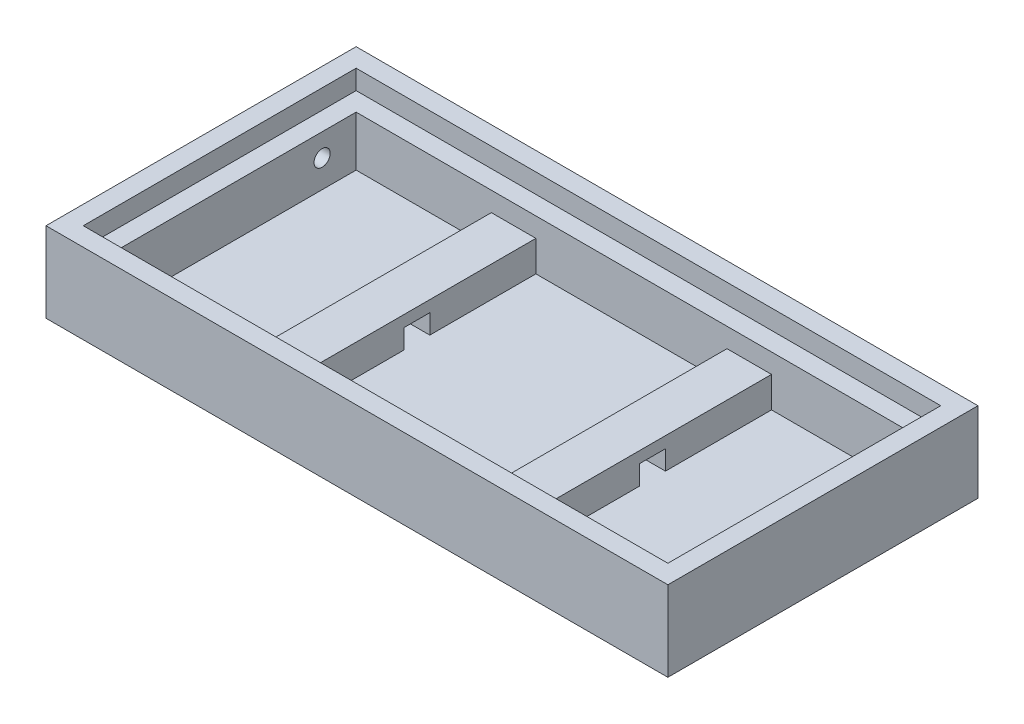
ISO-10303-21;
HEADER;
FILE_DESCRIPTION(('STEP AP214'),'2;1');
FILE_NAME('part.step','',(''),(''),'','','');
FILE_SCHEMA(('AUTOMOTIVE_DESIGN { 1 0 10303 214 1 1 1 1 }'));
ENDSEC;
DATA;
#1=APPLICATION_CONTEXT('core data for automotive mechanical design processes');
#2=APPLICATION_PROTOCOL_DEFINITION('international standard','automotive_design',2000,#1);
#3=PRODUCT_CONTEXT('',#1,'mechanical');
#4=PRODUCT('Part','Part','',(#3));
#5=PRODUCT_RELATED_PRODUCT_CATEGORY('part','',(#4));
#6=PRODUCT_DEFINITION_FORMATION('','',#4);
#7=PRODUCT_DEFINITION_CONTEXT('part definition',#1,'design');
#8=PRODUCT_DEFINITION('design','',#6,#7);
#9=PRODUCT_DEFINITION_SHAPE('','',#8);
#10=(LENGTH_UNIT() NAMED_UNIT(*) SI_UNIT(.MILLI.,.METRE.));
#11=(NAMED_UNIT(*) PLANE_ANGLE_UNIT() SI_UNIT($,.RADIAN.));
#12=(NAMED_UNIT(*) SI_UNIT($,.STERADIAN.) SOLID_ANGLE_UNIT());
#13=UNCERTAINTY_MEASURE_WITH_UNIT(LENGTH_MEASURE(1.E-05),#10,'distance_accuracy_value','');
#14=(GEOMETRIC_REPRESENTATION_CONTEXT(3) GLOBAL_UNCERTAINTY_ASSIGNED_CONTEXT((#13)) GLOBAL_UNIT_ASSIGNED_CONTEXT((#10,
#11,#12)) REPRESENTATION_CONTEXT('',''));
#15=CARTESIAN_POINT('',(0.,0.,0.));
#16=DIRECTION('',(0.,0.,1.));
#17=DIRECTION('',(1.,0.,0.));
#18=AXIS2_PLACEMENT_3D('',#15,#16,#17);
#19=CARTESIAN_POINT('',(73.025,119.0625,-73.025));
#20=DIRECTION('',(0.,0.,-1.));
#21=DIRECTION('',(-1.,0.,0.));
#22=AXIS2_PLACEMENT_3D('',#19,#20,#21);
#23=PLANE('',#22);
#24=DIRECTION('',(1.,0.,0.));
#25=VECTOR('',#24,1.);
#26=CARTESIAN_POINT('',(338.1375,80.9625,-73.025));
#27=LINE('',#26,#25);
#28=CARTESIAN_POINT('',(338.1375,80.9625,-73.025));
#29=VERTEX_POINT('',#28);
#30=CARTESIAN_POINT('',(425.45,80.9625,-73.025));
#31=VERTEX_POINT('',#30);
#32=EDGE_CURVE('E511',#29,#31,#27,.T.);
#33=ORIENTED_EDGE('',*,*,#32,.F.);
#34=DIRECTION('',(0.,-1.,0.));
#35=VECTOR('',#34,1.);
#36=CARTESIAN_POINT('',(338.1375,80.9625,-73.025));
#37=LINE('',#36,#35);
#38=CARTESIAN_POINT('',(338.1375,20.6375,-73.025));
#39=VERTEX_POINT('',#38);
#40=EDGE_CURVE('E478',#29,#39,#37,.T.);
#41=ORIENTED_EDGE('',*,*,#40,.T.);
#42=DIRECTION('',(1.,0.,0.));
#43=VECTOR('',#42,1.);
#44=CARTESIAN_POINT('',(73.025,20.6375,-73.025));
#45=LINE('',#44,#43);
#46=CARTESIAN_POINT('',(73.025,20.6375,-73.025));
#47=VERTEX_POINT('',#46);
#48=EDGE_CURVE('E307',#47,#39,#45,.T.);
#49=ORIENTED_EDGE('',*,*,#48,.F.);
#50=DIRECTION('',(0.,-1.,0.));
#51=VECTOR('',#50,1.);
#52=CARTESIAN_POINT('',(73.025,119.0625,-73.025));
#53=LINE('',#52,#51);
#54=CARTESIAN_POINT('',(73.025,119.0625,-73.025));
#55=VERTEX_POINT('',#54);
#56=EDGE_CURVE('E306',#55,#47,#53,.T.);
#57=ORIENTED_EDGE('',*,*,#56,.F.);
#58=DIRECTION('',(1.,0.,0.));
#59=VECTOR('',#58,1.);
#60=CARTESIAN_POINT('',(73.025,119.0625,-73.025));
#61=LINE('',#60,#59);
#62=CARTESIAN_POINT('',(1146.175,119.0625,-73.025));
#63=VERTEX_POINT('',#62);
#64=EDGE_CURVE('E292',#55,#63,#61,.T.);
#65=ORIENTED_EDGE('',*,*,#64,.T.);
#66=DIRECTION('',(0.,-1.,0.));
#67=VECTOR('',#66,1.);
#68=CARTESIAN_POINT('',(1146.175,119.0625,-73.025));
#69=LINE('',#68,#67);
#70=CARTESIAN_POINT('',(1146.175,20.6375,-73.025));
#71=VERTEX_POINT('',#70);
#72=EDGE_CURVE('E331',#63,#71,#69,.T.);
#73=ORIENTED_EDGE('',*,*,#72,.T.);
#74=CARTESIAN_POINT('',(887.4125,20.6375,-73.025));
#75=VERTEX_POINT('',#74);
#76=EDGE_CURVE('E291',#75,#71,#45,.T.);
#77=ORIENTED_EDGE('',*,*,#76,.F.);
#78=DIRECTION('',(0.,-1.,0.));
#79=VECTOR('',#78,1.);
#80=CARTESIAN_POINT('',(887.4125,80.9625,-73.025));
#81=LINE('',#80,#79);
#82=CARTESIAN_POINT('',(887.4125,80.9625,-73.025));
#83=VERTEX_POINT('',#82);
#84=EDGE_CURVE('E283',#83,#75,#81,.T.);
#85=ORIENTED_EDGE('',*,*,#84,.F.);
#86=DIRECTION('',(1.,0.,0.));
#87=VECTOR('',#86,1.);
#88=CARTESIAN_POINT('',(800.1,80.9625,-73.025));
#89=LINE('',#88,#87);
#90=CARTESIAN_POINT('',(800.1,80.9625,-73.025));
#91=VERTEX_POINT('',#90);
#92=EDGE_CURVE('E522',#91,#83,#89,.T.);
#93=ORIENTED_EDGE('',*,*,#92,.F.);
#94=DIRECTION('',(0.,-1.,0.));
#95=VECTOR('',#94,1.);
#96=CARTESIAN_POINT('',(800.1,80.9625,-73.025));
#97=LINE('',#96,#95);
#98=CARTESIAN_POINT('',(800.1,20.6375,-73.025));
#99=VERTEX_POINT('',#98);
#100=EDGE_CURVE('E287',#91,#99,#97,.T.);
#101=ORIENTED_EDGE('',*,*,#100,.T.);
#102=CARTESIAN_POINT('',(425.45,20.6375,-73.025));
#103=VERTEX_POINT('',#102);
#104=EDGE_CURVE('E312',#103,#99,#45,.T.);
#105=ORIENTED_EDGE('',*,*,#104,.F.);
#106=DIRECTION('',(0.,-1.,0.));
#107=VECTOR('',#106,1.);
#108=CARTESIAN_POINT('',(425.45,80.9625,-73.025));
#109=LINE('',#108,#107);
#110=EDGE_CURVE('E482',#31,#103,#109,.T.);
#111=ORIENTED_EDGE('',*,*,#110,.F.);
#112=EDGE_LOOP('',(#33,#41,#49,#57,#65,#73,#77,#85,#93,#101,#105,#111));
#113=FACE_BOUND('',#112,.T.);
#114=ADVANCED_FACE('F52',(#113),#23,.T.);
#115=CARTESIAN_POINT('',(1146.175,119.0625,-534.9875));
#116=DIRECTION('',(0.,0.,1.));
#117=DIRECTION('',(1.,0.,0.));
#118=AXIS2_PLACEMENT_3D('',#115,#116,#117);
#119=PLANE('',#118);
#120=DIRECTION('',(-1.,0.,0.));
#121=VECTOR('',#120,1.);
#122=CARTESIAN_POINT('',(1146.175,20.6375,-534.9875));
#123=LINE('',#122,#121);
#124=CARTESIAN_POINT('',(338.1375,20.6375,-534.9875));
#125=VERTEX_POINT('',#124);
#126=CARTESIAN_POINT('',(73.025,20.6375,-534.9875));
#127=VERTEX_POINT('',#126);
#128=EDGE_CURVE('E315',#125,#127,#123,.T.);
#129=ORIENTED_EDGE('',*,*,#128,.F.);
#130=DIRECTION('',(0.,-1.,0.));
#131=VECTOR('',#130,1.);
#132=CARTESIAN_POINT('',(338.1375,80.9625,-534.9875));
#133=LINE('',#132,#131);
#134=CARTESIAN_POINT('',(338.1375,80.9625,-534.9875));
#135=VERTEX_POINT('',#134);
#136=EDGE_CURVE('E490',#135,#125,#133,.T.);
#137=ORIENTED_EDGE('',*,*,#136,.F.);
#138=DIRECTION('',(-1.,0.,0.));
#139=VECTOR('',#138,1.);
#140=CARTESIAN_POINT('',(338.1375,80.9625,-534.9875));
#141=LINE('',#140,#139);
#142=CARTESIAN_POINT('',(425.45,80.9625,-534.9875));
#143=VERTEX_POINT('',#142);
#144=EDGE_CURVE('E494',#143,#135,#141,.T.);
#145=ORIENTED_EDGE('',*,*,#144,.F.);
#146=DIRECTION('',(0.,-1.,0.));
#147=VECTOR('',#146,1.);
#148=CARTESIAN_POINT('',(425.45,80.9625,-534.9875));
#149=LINE('',#148,#147);
#150=CARTESIAN_POINT('',(425.45,20.6375,-534.9875));
#151=VERTEX_POINT('',#150);
#152=EDGE_CURVE('E486',#143,#151,#149,.T.);
#153=ORIENTED_EDGE('',*,*,#152,.T.);
#154=CARTESIAN_POINT('',(800.1,20.6375,-534.9875));
#155=VERTEX_POINT('',#154);
#156=EDGE_CURVE('E318',#155,#151,#123,.T.);
#157=ORIENTED_EDGE('',*,*,#156,.F.);
#158=DIRECTION('',(0.,-1.,0.));
#159=VECTOR('',#158,1.);
#160=CARTESIAN_POINT('',(800.1,80.9625,-534.9875));
#161=LINE('',#160,#159);
#162=CARTESIAN_POINT('',(800.1,80.9625,-534.9875));
#163=VERTEX_POINT('',#162);
#164=EDGE_CURVE('E275',#163,#155,#161,.T.);
#165=ORIENTED_EDGE('',*,*,#164,.F.);
#166=DIRECTION('',(-1.,0.,0.));
#167=VECTOR('',#166,1.);
#168=CARTESIAN_POINT('',(800.1,80.9625,-534.9875));
#169=LINE('',#168,#167);
#170=CARTESIAN_POINT('',(887.4125,80.9625,-534.9875));
#171=VERTEX_POINT('',#170);
#172=EDGE_CURVE('E280',#171,#163,#169,.T.);
#173=ORIENTED_EDGE('',*,*,#172,.F.);
#174=DIRECTION('',(0.,-1.,0.));
#175=VECTOR('',#174,1.);
#176=CARTESIAN_POINT('',(887.4125,80.9625,-534.9875));
#177=LINE('',#176,#175);
#178=CARTESIAN_POINT('',(887.4125,20.6375,-534.9875));
#179=VERTEX_POINT('',#178);
#180=EDGE_CURVE('E279',#171,#179,#177,.T.);
#181=ORIENTED_EDGE('',*,*,#180,.T.);
#182=CARTESIAN_POINT('',(1146.175,20.6375,-534.9875));
#183=VERTEX_POINT('',#182);
#184=EDGE_CURVE('E262',#183,#179,#123,.T.);
#185=ORIENTED_EDGE('',*,*,#184,.F.);
#186=DIRECTION('',(0.,-1.,0.));
#187=VECTOR('',#186,1.);
#188=CARTESIAN_POINT('',(1146.175,119.0625,-534.9875));
#189=LINE('',#188,#187);
#190=CARTESIAN_POINT('',(1146.175,119.0625,-534.9875));
#191=VERTEX_POINT('',#190);
#192=EDGE_CURVE('E328',#191,#183,#189,.T.);
#193=ORIENTED_EDGE('',*,*,#192,.F.);
#194=DIRECTION('',(-1.,0.,0.));
#195=VECTOR('',#194,1.);
#196=CARTESIAN_POINT('',(1146.175,119.0625,-534.9875));
#197=LINE('',#196,#195);
#198=CARTESIAN_POINT('',(73.025,119.0625,-534.9875));
#199=VERTEX_POINT('',#198);
#200=EDGE_CURVE('E299',#191,#199,#197,.T.);
#201=ORIENTED_EDGE('',*,*,#200,.T.);
#202=DIRECTION('',(0.,-1.,0.));
#203=VECTOR('',#202,1.);
#204=CARTESIAN_POINT('',(73.025,119.0625,-534.9875));
#205=LINE('',#204,#203);
#206=EDGE_CURVE('E324',#199,#127,#205,.T.);
#207=ORIENTED_EDGE('',*,*,#206,.T.);
#208=EDGE_LOOP('',(#129,#137,#145,#153,#157,#165,#173,#181,#185,#193,#201,#207));
#209=FACE_BOUND('',#208,.T.);
#210=ADVANCED_FACE('F545',(#209),#119,.T.);
#211=CARTESIAN_POINT('',(0.,20.6375,0.));
#212=DIRECTION('',(0.,-1.,0.));
#213=DIRECTION('',(0.,0.,-1.));
#214=AXIS2_PLACEMENT_3D('',#211,#212,#213);
#215=PLANE('',#214);
#216=DIRECTION('',(0.,0.,-1.));
#217=VECTOR('',#216,1.);
#218=CARTESIAN_POINT('',(887.4125,20.6375,-534.9875));
#219=LINE('',#218,#217);
#220=CARTESIAN_POINT('',(887.4125,20.6375,-276.225));
#221=VERTEX_POINT('',#220);
#222=EDGE_CURVE('E265',#75,#221,#219,.T.);
#223=ORIENTED_EDGE('',*,*,#222,.F.);
#224=ORIENTED_EDGE('',*,*,#76,.T.);
#225=DIRECTION('',(0.,0.,-1.));
#226=VECTOR('',#225,1.);
#227=CARTESIAN_POINT('',(1146.175,20.6375,-73.025));
#228=LINE('',#227,#226);
#229=EDGE_CURVE('E311',#71,#183,#228,.T.);
#230=ORIENTED_EDGE('',*,*,#229,.T.);
#231=ORIENTED_EDGE('',*,*,#184,.T.);
#232=CARTESIAN_POINT('',(887.4125,20.6375,-327.025));
#233=VERTEX_POINT('',#232);
#234=EDGE_CURVE('E253',#233,#179,#219,.T.);
#235=ORIENTED_EDGE('',*,*,#234,.F.);
#236=DIRECTION('',(1.,0.,0.));
#237=VECTOR('',#236,1.);
#238=CARTESIAN_POINT('',(274.6375,20.6375,-327.025));
#239=LINE('',#238,#237);
#240=CARTESIAN_POINT('',(800.1,20.6375,-327.025));
#241=VERTEX_POINT('',#240);
#242=EDGE_CURVE('E68',#241,#233,#239,.T.);
#243=ORIENTED_EDGE('',*,*,#242,.F.);
#244=DIRECTION('',(0.,0.,1.));
#245=VECTOR('',#244,1.);
#246=CARTESIAN_POINT('',(800.1,20.6375,-534.9875));
#247=LINE('',#246,#245);
#248=EDGE_CURVE('E266',#155,#241,#247,.T.);
#249=ORIENTED_EDGE('',*,*,#248,.F.);
#250=ORIENTED_EDGE('',*,*,#156,.T.);
#251=DIRECTION('',(0.,0.,-1.));
#252=VECTOR('',#251,1.);
#253=CARTESIAN_POINT('',(425.45,20.6375,-534.9875));
#254=LINE('',#253,#252);
#255=CARTESIAN_POINT('',(425.45,20.6375,-327.025));
#256=VERTEX_POINT('',#255);
#257=EDGE_CURVE('E499',#256,#151,#254,.T.);
#258=ORIENTED_EDGE('',*,*,#257,.F.);
#259=CARTESIAN_POINT('',(338.1375,20.6375,-327.025));
#260=VERTEX_POINT('',#259);
#261=EDGE_CURVE('E246',#260,#256,#239,.T.);
#262=ORIENTED_EDGE('',*,*,#261,.F.);
#263=DIRECTION('',(0.,0.,1.));
#264=VECTOR('',#263,1.);
#265=CARTESIAN_POINT('',(338.1375,20.6375,-534.9875));
#266=LINE('',#265,#264);
#267=EDGE_CURVE('E500',#125,#260,#266,.T.);
#268=ORIENTED_EDGE('',*,*,#267,.F.);
#269=ORIENTED_EDGE('',*,*,#128,.T.);
#270=DIRECTION('',(0.,0.,1.));
#271=VECTOR('',#270,1.);
#272=CARTESIAN_POINT('',(73.025,20.6375,-534.9875));
#273=LINE('',#272,#271);
#274=EDGE_CURVE('E296',#127,#47,#273,.T.);
#275=ORIENTED_EDGE('',*,*,#274,.T.);
#276=ORIENTED_EDGE('',*,*,#48,.T.);
#277=CARTESIAN_POINT('',(338.1375,20.6375,-276.225));
#278=VERTEX_POINT('',#277);
#279=EDGE_CURVE('E498',#278,#39,#266,.T.);
#280=ORIENTED_EDGE('',*,*,#279,.F.);
#281=DIRECTION('',(1.,0.,0.));
#282=VECTOR('',#281,1.);
#283=CARTESIAN_POINT('',(274.6375,20.6375,-276.225));
#284=LINE('',#283,#282);
#285=CARTESIAN_POINT('',(425.45,20.6375,-276.225));
#286=VERTEX_POINT('',#285);
#287=EDGE_CURVE('E247',#278,#286,#284,.T.);
#288=ORIENTED_EDGE('',*,*,#287,.T.);
#289=EDGE_CURVE('E495',#103,#286,#254,.T.);
#290=ORIENTED_EDGE('',*,*,#289,.F.);
#291=ORIENTED_EDGE('',*,*,#104,.T.);
#292=CARTESIAN_POINT('',(800.1,20.6375,-276.225));
#293=VERTEX_POINT('',#292);
#294=EDGE_CURVE('E271',#293,#99,#247,.T.);
#295=ORIENTED_EDGE('',*,*,#294,.F.);
#296=EDGE_CURVE('E467',#293,#221,#284,.T.);
#297=ORIENTED_EDGE('',*,*,#296,.T.);
#298=EDGE_LOOP('',(#223,#224,#230,#231,#235,#243,#249,#250,#258,#262,#268,#269,#275,#276,#280,
#288,#290,#291,#295,#297));
#299=FACE_BOUND('',#298,.T.);
#300=ADVANCED_FACE('F259',(#299),#215,.F.);
#301=CARTESIAN_POINT('',(0.,20.6375,0.));
#302=DIRECTION('',(1.,0.,0.));
#303=DIRECTION('',(0.,0.,-1.));
#304=AXIS2_PLACEMENT_3D('',#301,#302,#303);
#305=PLANE('',#304);
#306=CARTESIAN_POINT('',(0.,74.6125,-468.3125));
#307=DIRECTION('',(1.,0.,0.));
#308=DIRECTION('',(0.,0.,-1.));
#309=AXIS2_PLACEMENT_3D('',#306,#307,#308);
#310=CIRCLE('',#309,15.875);
#311=CARTESIAN_POINT('',(0.,74.6125,-484.1875));
#312=VERTEX_POINT('',#311);
#313=EDGE_CURVE('E578',#312,#312,#310,.F.);
#314=ORIENTED_EDGE('',*,*,#313,.F.);
#315=EDGE_LOOP('',(#314));
#316=FACE_BOUND('',#315,.T.);
#317=DIRECTION('',(0.,0.,1.));
#318=VECTOR('',#317,1.);
#319=CARTESIAN_POINT('',(0.,0.,0.));
#320=LINE('',#319,#318);
#321=CARTESIAN_POINT('',(0.,0.,-608.0125));
#322=VERTEX_POINT('',#321);
#323=CARTESIAN_POINT('',(0.,0.,0.));
#324=VERTEX_POINT('',#323);
#325=EDGE_CURVE('E398',#322,#324,#320,.T.);
#326=ORIENTED_EDGE('',*,*,#325,.T.);
#327=DIRECTION('',(0.,-1.,0.));
#328=VECTOR('',#327,1.);
#329=CARTESIAN_POINT('',(0.,20.6375,0.));
#330=LINE('',#329,#328);
#331=CARTESIAN_POINT('',(0.,157.1625,0.));
#332=VERTEX_POINT('',#331);
#333=EDGE_CURVE('E422',#332,#324,#330,.T.);
#334=ORIENTED_EDGE('',*,*,#333,.F.);
#335=DIRECTION('',(0.,0.,1.));
#336=VECTOR('',#335,1.);
#337=CARTESIAN_POINT('',(0.,157.1625,-608.0125));
#338=LINE('',#337,#336);
#339=CARTESIAN_POINT('',(0.,157.1625,-608.0125));
#340=VERTEX_POINT('',#339);
#341=EDGE_CURVE('E382',#340,#332,#338,.T.);
#342=ORIENTED_EDGE('',*,*,#341,.F.);
#343=DIRECTION('',(0.,-1.,0.));
#344=VECTOR('',#343,1.);
#345=CARTESIAN_POINT('',(0.,20.6375,-608.0125));
#346=LINE('',#345,#344);
#347=EDGE_CURVE('E411',#340,#322,#346,.T.);
#348=ORIENTED_EDGE('',*,*,#347,.T.);
#349=EDGE_LOOP('',(#326,#334,#342,#348));
#350=FACE_BOUND('',#349,.T.);
#351=ADVANCED_FACE('F54',(#316,#350),#305,.F.);
#352=CARTESIAN_POINT('',(0.,20.6375,0.));
#353=DIRECTION('',(0.,0.,-1.));
#354=DIRECTION('',(-1.,0.,0.));
#355=AXIS2_PLACEMENT_3D('',#352,#353,#354);
#356=PLANE('',#355);
#357=DIRECTION('',(1.,0.,0.));
#358=VECTOR('',#357,1.);
#359=CARTESIAN_POINT('',(0.,0.,0.));
#360=LINE('',#359,#358);
#361=CARTESIAN_POINT('',(1219.2,0.,0.));
#362=VERTEX_POINT('',#361);
#363=EDGE_CURVE('E402',#324,#362,#360,.T.);
#364=ORIENTED_EDGE('',*,*,#363,.T.);
#365=DIRECTION('',(0.,-1.,0.));
#366=VECTOR('',#365,1.);
#367=CARTESIAN_POINT('',(1219.2,20.6375,0.));
#368=LINE('',#367,#366);
#369=CARTESIAN_POINT('',(1219.2,157.1625,0.));
#370=VERTEX_POINT('',#369);
#371=EDGE_CURVE('E418',#370,#362,#368,.T.);
#372=ORIENTED_EDGE('',*,*,#371,.F.);
#373=DIRECTION('',(1.,0.,0.));
#374=VECTOR('',#373,1.);
#375=CARTESIAN_POINT('',(0.,157.1625,0.));
#376=LINE('',#375,#374);
#377=EDGE_CURVE('E386',#332,#370,#376,.T.);
#378=ORIENTED_EDGE('',*,*,#377,.F.);
#379=ORIENTED_EDGE('',*,*,#333,.T.);
#380=EDGE_LOOP('',(#364,#372,#378,#379));
#381=FACE_BOUND('',#380,.T.);
#382=ADVANCED_FACE('F641',(#381),#356,.F.);
#383=CARTESIAN_POINT('',(1219.2,20.6375,0.));
#384=DIRECTION('',(-1.,0.,0.));
#385=DIRECTION('',(0.,0.,1.));
#386=AXIS2_PLACEMENT_3D('',#383,#384,#385);
#387=PLANE('',#386);
#388=DIRECTION('',(0.,0.,-1.));
#389=VECTOR('',#388,1.);
#390=CARTESIAN_POINT('',(1219.2,0.,0.));
#391=LINE('',#390,#389);
#392=CARTESIAN_POINT('',(1219.2,0.,-608.0125));
#393=VERTEX_POINT('',#392);
#394=EDGE_CURVE('E405',#362,#393,#391,.T.);
#395=ORIENTED_EDGE('',*,*,#394,.T.);
#396=DIRECTION('',(0.,-1.,0.));
#397=VECTOR('',#396,1.);
#398=CARTESIAN_POINT('',(1219.2,20.6375,-608.0125));
#399=LINE('',#398,#397);
#400=CARTESIAN_POINT('',(1219.2,157.1625,-608.0125));
#401=VERTEX_POINT('',#400);
#402=EDGE_CURVE('E415',#401,#393,#399,.T.);
#403=ORIENTED_EDGE('',*,*,#402,.F.);
#404=DIRECTION('',(0.,0.,-1.));
#405=VECTOR('',#404,1.);
#406=CARTESIAN_POINT('',(1219.2,157.1625,0.));
#407=LINE('',#406,#405);
#408=EDGE_CURVE('E390',#370,#401,#407,.T.);
#409=ORIENTED_EDGE('',*,*,#408,.F.);
#410=ORIENTED_EDGE('',*,*,#371,.T.);
#411=EDGE_LOOP('',(#395,#403,#409,#410));
#412=FACE_BOUND('',#411,.T.);
#413=ADVANCED_FACE('F638',(#412),#387,.F.);
#414=CARTESIAN_POINT('',(0.,20.6375,-608.0125));
#415=DIRECTION('',(0.,0.,1.));
#416=DIRECTION('',(1.,0.,0.));
#417=AXIS2_PLACEMENT_3D('',#414,#415,#416);
#418=PLANE('',#417);
#419=DIRECTION('',(-1.,0.,0.));
#420=VECTOR('',#419,1.);
#421=CARTESIAN_POINT('',(0.,0.,-608.0125));
#422=LINE('',#421,#420);
#423=EDGE_CURVE('E408',#393,#322,#422,.T.);
#424=ORIENTED_EDGE('',*,*,#423,.T.);
#425=ORIENTED_EDGE('',*,*,#347,.F.);
#426=DIRECTION('',(-1.,0.,0.));
#427=VECTOR('',#426,1.);
#428=CARTESIAN_POINT('',(1219.2,157.1625,-608.0125));
#429=LINE('',#428,#427);
#430=EDGE_CURVE('E394',#401,#340,#429,.T.);
#431=ORIENTED_EDGE('',*,*,#430,.F.);
#432=ORIENTED_EDGE('',*,*,#402,.T.);
#433=EDGE_LOOP('',(#424,#425,#431,#432));
#434=FACE_BOUND('',#433,.T.);
#435=ADVANCED_FACE('F634',(#434),#418,.F.);
#436=CARTESIAN_POINT('',(0.,0.,0.));
#437=DIRECTION('',(0.,-1.,0.));
#438=DIRECTION('',(0.,0.,-1.));
#439=AXIS2_PLACEMENT_3D('',#436,#437,#438);
#440=PLANE('',#439);
#441=ORIENTED_EDGE('',*,*,#325,.F.);
#442=ORIENTED_EDGE('',*,*,#423,.F.);
#443=ORIENTED_EDGE('',*,*,#394,.F.);
#444=ORIENTED_EDGE('',*,*,#363,.F.);
#445=EDGE_LOOP('',(#441,#442,#443,#444));
#446=FACE_BOUND('',#445,.T.);
#447=ADVANCED_FACE('F628',(#446),#440,.T.);
#448=CARTESIAN_POINT('',(0.,157.1625,0.));
#449=DIRECTION('',(0.,1.,0.));
#450=DIRECTION('',(0.,0.,1.));
#451=AXIS2_PLACEMENT_3D('',#448,#449,#450);
#452=PLANE('',#451);
#453=ORIENTED_EDGE('',*,*,#341,.T.);
#454=ORIENTED_EDGE('',*,*,#377,.T.);
#455=ORIENTED_EDGE('',*,*,#408,.T.);
#456=ORIENTED_EDGE('',*,*,#430,.T.);
#457=EDGE_LOOP('',(#453,#454,#455,#456));
#458=FACE_BOUND('',#457,.T.);
#459=DIRECTION('',(0.,0.,-1.));
#460=VECTOR('',#459,1.);
#461=CARTESIAN_POINT('',(1182.6875,157.1625,-36.5125));
#462=LINE('',#461,#460);
#463=CARTESIAN_POINT('',(1182.6875,157.1625,-36.5125));
#464=VERTEX_POINT('',#463);
#465=CARTESIAN_POINT('',(1182.6875,157.1625,-571.5));
#466=VERTEX_POINT('',#465);
#467=EDGE_CURVE('E354',#464,#466,#462,.T.);
#468=ORIENTED_EDGE('',*,*,#467,.F.);
#469=DIRECTION('',(1.,0.,0.));
#470=VECTOR('',#469,1.);
#471=CARTESIAN_POINT('',(36.5125,157.1625,-36.5125));
#472=LINE('',#471,#470);
#473=CARTESIAN_POINT('',(36.5125,157.1625,-36.5125));
#474=VERTEX_POINT('',#473);
#475=EDGE_CURVE('E351',#474,#464,#472,.T.);
#476=ORIENTED_EDGE('',*,*,#475,.F.);
#477=DIRECTION('',(0.,0.,1.));
#478=VECTOR('',#477,1.);
#479=CARTESIAN_POINT('',(36.5125,157.1625,-571.5));
#480=LINE('',#479,#478);
#481=CARTESIAN_POINT('',(36.5125,157.1625,-571.5));
#482=VERTEX_POINT('',#481);
#483=EDGE_CURVE('E363',#482,#474,#480,.T.);
#484=ORIENTED_EDGE('',*,*,#483,.F.);
#485=DIRECTION('',(-1.,0.,0.));
#486=VECTOR('',#485,1.);
#487=CARTESIAN_POINT('',(1182.6875,157.1625,-571.5));
#488=LINE('',#487,#486);
#489=EDGE_CURVE('E358',#466,#482,#488,.T.);
#490=ORIENTED_EDGE('',*,*,#489,.F.);
#491=EDGE_LOOP('',(#468,#476,#484,#490));
#492=FACE_BOUND('',#491,.T.);
#493=ADVANCED_FACE('F624',(#458,#492),#452,.T.);
#494=CARTESIAN_POINT('',(36.5125,157.1625,-36.5125));
#495=DIRECTION('',(0.,0.,-1.));
#496=DIRECTION('',(-1.,0.,0.));
#497=AXIS2_PLACEMENT_3D('',#494,#495,#496);
#498=PLANE('',#497);
#499=DIRECTION('',(1.,0.,0.));
#500=VECTOR('',#499,1.);
#501=CARTESIAN_POINT('',(36.5125,119.0625,-36.5125));
#502=LINE('',#501,#500);
#503=CARTESIAN_POINT('',(36.5125,119.0625,-36.5125));
#504=VERTEX_POINT('',#503);
#505=CARTESIAN_POINT('',(1182.6875,119.0625,-36.5125));
#506=VERTEX_POINT('',#505);
#507=EDGE_CURVE('E339',#504,#506,#502,.T.);
#508=ORIENTED_EDGE('',*,*,#507,.F.);
#509=DIRECTION('',(0.,-1.,0.));
#510=VECTOR('',#509,1.);
#511=CARTESIAN_POINT('',(36.5125,157.1625,-36.5125));
#512=LINE('',#511,#510);
#513=EDGE_CURVE('E367',#474,#504,#512,.T.);
#514=ORIENTED_EDGE('',*,*,#513,.F.);
#515=ORIENTED_EDGE('',*,*,#475,.T.);
#516=DIRECTION('',(0.,-1.,0.));
#517=VECTOR('',#516,1.);
#518=CARTESIAN_POINT('',(1182.6875,157.1625,-36.5125));
#519=LINE('',#518,#517);
#520=EDGE_CURVE('E378',#464,#506,#519,.T.);
#521=ORIENTED_EDGE('',*,*,#520,.T.);
#522=EDGE_LOOP('',(#508,#514,#515,#521));
#523=FACE_BOUND('',#522,.T.);
#524=ADVANCED_FACE('F620',(#523),#498,.T.);
#525=CARTESIAN_POINT('',(1182.6875,157.1625,-36.5125));
#526=DIRECTION('',(-1.,0.,0.));
#527=DIRECTION('',(0.,0.,1.));
#528=AXIS2_PLACEMENT_3D('',#525,#526,#527);
#529=PLANE('',#528);
#530=DIRECTION('',(0.,0.,-1.));
#531=VECTOR('',#530,1.);
#532=CARTESIAN_POINT('',(1182.6875,119.0625,-36.5125));
#533=LINE('',#532,#531);
#534=CARTESIAN_POINT('',(1182.6875,119.0625,-571.5));
#535=VERTEX_POINT('',#534);
#536=EDGE_CURVE('E343',#506,#535,#533,.T.);
#537=ORIENTED_EDGE('',*,*,#536,.F.);
#538=ORIENTED_EDGE('',*,*,#520,.F.);
#539=ORIENTED_EDGE('',*,*,#467,.T.);
#540=DIRECTION('',(0.,-1.,0.));
#541=VECTOR('',#540,1.);
#542=CARTESIAN_POINT('',(1182.6875,157.1625,-571.5));
#543=LINE('',#542,#541);
#544=EDGE_CURVE('E374',#466,#535,#543,.T.);
#545=ORIENTED_EDGE('',*,*,#544,.T.);
#546=EDGE_LOOP('',(#537,#538,#539,#545));
#547=FACE_BOUND('',#546,.T.);
#548=ADVANCED_FACE('F616',(#547),#529,.T.);
#549=CARTESIAN_POINT('',(1182.6875,157.1625,-571.5));
#550=DIRECTION('',(0.,0.,1.));
#551=DIRECTION('',(1.,0.,0.));
#552=AXIS2_PLACEMENT_3D('',#549,#550,#551);
#553=PLANE('',#552);
#554=DIRECTION('',(-1.,0.,0.));
#555=VECTOR('',#554,1.);
#556=CARTESIAN_POINT('',(1182.6875,119.0625,-571.5));
#557=LINE('',#556,#555);
#558=CARTESIAN_POINT('',(36.5125,119.0625,-571.5));
#559=VERTEX_POINT('',#558);
#560=EDGE_CURVE('E347',#535,#559,#557,.T.);
#561=ORIENTED_EDGE('',*,*,#560,.F.);
#562=ORIENTED_EDGE('',*,*,#544,.F.);
#563=ORIENTED_EDGE('',*,*,#489,.T.);
#564=DIRECTION('',(0.,-1.,0.));
#565=VECTOR('',#564,1.);
#566=CARTESIAN_POINT('',(36.5125,157.1625,-571.5));
#567=LINE('',#566,#565);
#568=EDGE_CURVE('E370',#482,#559,#567,.T.);
#569=ORIENTED_EDGE('',*,*,#568,.T.);
#570=EDGE_LOOP('',(#561,#562,#563,#569));
#571=FACE_BOUND('',#570,.T.);
#572=ADVANCED_FACE('F612',(#571),#553,.T.);
#573=CARTESIAN_POINT('',(36.5125,157.1625,-571.5));
#574=DIRECTION('',(1.,0.,0.));
#575=DIRECTION('',(0.,0.,-1.));
#576=AXIS2_PLACEMENT_3D('',#573,#574,#575);
#577=PLANE('',#576);
#578=DIRECTION('',(0.,0.,1.));
#579=VECTOR('',#578,1.);
#580=CARTESIAN_POINT('',(36.5125,119.0625,-571.5));
#581=LINE('',#580,#579);
#582=EDGE_CURVE('E335',#559,#504,#581,.T.);
#583=ORIENTED_EDGE('',*,*,#582,.F.);
#584=ORIENTED_EDGE('',*,*,#568,.F.);
#585=ORIENTED_EDGE('',*,*,#483,.T.);
#586=ORIENTED_EDGE('',*,*,#513,.T.);
#587=EDGE_LOOP('',(#583,#584,#585,#586));
#588=FACE_BOUND('',#587,.T.);
#589=ADVANCED_FACE('F608',(#588),#577,.T.);
#590=CARTESIAN_POINT('',(0.,119.0625,0.));
#591=DIRECTION('',(0.,1.,0.));
#592=DIRECTION('',(0.,0.,1.));
#593=AXIS2_PLACEMENT_3D('',#590,#591,#592);
#594=PLANE('',#593);
#595=ORIENTED_EDGE('',*,*,#582,.T.);
#596=ORIENTED_EDGE('',*,*,#507,.T.);
#597=ORIENTED_EDGE('',*,*,#536,.T.);
#598=ORIENTED_EDGE('',*,*,#560,.T.);
#599=EDGE_LOOP('',(#595,#596,#597,#598));
#600=FACE_BOUND('',#599,.T.);
#601=DIRECTION('',(0.,0.,-1.));
#602=VECTOR('',#601,1.);
#603=CARTESIAN_POINT('',(1146.175,119.0625,-73.025));
#604=LINE('',#603,#602);
#605=EDGE_CURVE('E295',#63,#191,#604,.T.);
#606=ORIENTED_EDGE('',*,*,#605,.F.);
#607=ORIENTED_EDGE('',*,*,#64,.F.);
#608=DIRECTION('',(0.,0.,1.));
#609=VECTOR('',#608,1.);
#610=CARTESIAN_POINT('',(73.025,119.0625,-534.9875));
#611=LINE('',#610,#609);
#612=EDGE_CURVE('E303',#199,#55,#611,.T.);
#613=ORIENTED_EDGE('',*,*,#612,.F.);
#614=ORIENTED_EDGE('',*,*,#200,.F.);
#615=EDGE_LOOP('',(#606,#607,#613,#614));
#616=FACE_BOUND('',#615,.T.);
#617=ADVANCED_FACE('F558',(#600,#616),#594,.T.);
#618=CARTESIAN_POINT('',(1146.175,119.0625,-73.025));
#619=DIRECTION('',(-1.,0.,0.));
#620=DIRECTION('',(0.,0.,1.));
#621=AXIS2_PLACEMENT_3D('',#618,#619,#620);
#622=PLANE('',#621);
#623=ORIENTED_EDGE('',*,*,#229,.F.);
#624=ORIENTED_EDGE('',*,*,#72,.F.);
#625=ORIENTED_EDGE('',*,*,#605,.T.);
#626=ORIENTED_EDGE('',*,*,#192,.T.);
#627=EDGE_LOOP('',(#623,#624,#625,#626));
#628=FACE_BOUND('',#627,.T.);
#629=ADVANCED_FACE('F551',(#628),#622,.T.);
#630=CARTESIAN_POINT('',(73.025,119.0625,-534.9875));
#631=DIRECTION('',(1.,0.,0.));
#632=DIRECTION('',(0.,0.,-1.));
#633=AXIS2_PLACEMENT_3D('',#630,#631,#632);
#634=PLANE('',#633);
#635=CARTESIAN_POINT('',(73.025,74.6125,-468.3125));
#636=DIRECTION('',(1.,0.,0.));
#637=DIRECTION('',(0.,0.,-1.));
#638=AXIS2_PLACEMENT_3D('',#635,#636,#637);
#639=CIRCLE('',#638,15.875);
#640=CARTESIAN_POINT('',(73.025,74.6125,-484.1875));
#641=VERTEX_POINT('',#640);
#642=EDGE_CURVE('E581',#641,#641,#639,.T.);
#643=ORIENTED_EDGE('',*,*,#642,.F.);
#644=EDGE_LOOP('',(#643));
#645=FACE_BOUND('',#644,.T.);
#646=ORIENTED_EDGE('',*,*,#274,.F.);
#647=ORIENTED_EDGE('',*,*,#206,.F.);
#648=ORIENTED_EDGE('',*,*,#612,.T.);
#649=ORIENTED_EDGE('',*,*,#56,.T.);
#650=EDGE_LOOP('',(#646,#647,#648,#649));
#651=FACE_BOUND('',#650,.T.);
#652=ADVANCED_FACE('F561',(#645,#651),#634,.T.);
#653=CARTESIAN_POINT('',(800.1,80.9625,-534.9875));
#654=DIRECTION('',(1.,0.,0.));
#655=DIRECTION('',(0.,0.,-1.));
#656=AXIS2_PLACEMENT_3D('',#653,#654,#655);
#657=PLANE('',#656);
#658=DIRECTION('',(0.,0.,1.));
#659=VECTOR('',#658,1.);
#660=CARTESIAN_POINT('',(800.1,58.7375,-534.9875));
#661=LINE('',#660,#659);
#662=CARTESIAN_POINT('',(800.1,58.7375,-327.025));
#663=VERTEX_POINT('',#662);
#664=CARTESIAN_POINT('',(800.1,58.7375,-276.225));
#665=VERTEX_POINT('',#664);
#666=EDGE_CURVE('E470',#663,#665,#661,.T.);
#667=ORIENTED_EDGE('',*,*,#666,.T.);
#668=DIRECTION('',(0.,-1.,0.));
#669=VECTOR('',#668,1.);
#670=CARTESIAN_POINT('',(800.1,80.9625,-276.225));
#671=LINE('',#670,#669);
#672=EDGE_CURVE('E474',#665,#293,#671,.T.);
#673=ORIENTED_EDGE('',*,*,#672,.T.);
#674=ORIENTED_EDGE('',*,*,#294,.T.);
#675=ORIENTED_EDGE('',*,*,#100,.F.);
#676=DIRECTION('',(0.,0.,1.));
#677=VECTOR('',#676,1.);
#678=CARTESIAN_POINT('',(800.1,80.9625,-534.9875));
#679=LINE('',#678,#677);
#680=EDGE_CURVE('E270',#163,#91,#679,.T.);
#681=ORIENTED_EDGE('',*,*,#680,.F.);
#682=ORIENTED_EDGE('',*,*,#164,.T.);
#683=ORIENTED_EDGE('',*,*,#248,.T.);
#684=DIRECTION('',(0.,1.,0.));
#685=VECTOR('',#684,1.);
#686=CARTESIAN_POINT('',(800.1,80.9625,-327.025));
#687=LINE('',#686,#685);
#688=EDGE_CURVE('E243',#241,#663,#687,.T.);
#689=ORIENTED_EDGE('',*,*,#688,.T.);
#690=EDGE_LOOP('',(#667,#673,#674,#675,#681,#682,#683,#689));
#691=FACE_BOUND('',#690,.T.);
#692=ADVANCED_FACE('F538',(#691),#657,.F.);
#693=CARTESIAN_POINT('',(887.4125,80.9625,-534.9875));
#694=DIRECTION('',(-1.,0.,0.));
#695=DIRECTION('',(0.,0.,1.));
#696=AXIS2_PLACEMENT_3D('',#693,#694,#695);
#697=PLANE('',#696);
#698=ORIENTED_EDGE('',*,*,#222,.T.);
#699=DIRECTION('',(0.,-1.,0.));
#700=VECTOR('',#699,1.);
#701=CARTESIAN_POINT('',(887.4125,20.6375,-276.225));
#702=LINE('',#701,#700);
#703=CARTESIAN_POINT('',(887.4125,58.7375,-276.225));
#704=VERTEX_POINT('',#703);
#705=EDGE_CURVE('E76',#704,#221,#702,.T.);
#706=ORIENTED_EDGE('',*,*,#705,.F.);
#707=DIRECTION('',(0.,0.,1.));
#708=VECTOR('',#707,1.);
#709=CARTESIAN_POINT('',(887.4125,58.7375,-276.225));
#710=LINE('',#709,#708);
#711=CARTESIAN_POINT('',(887.4125,58.7375,-327.025));
#712=VERTEX_POINT('',#711);
#713=EDGE_CURVE('E256',#712,#704,#710,.T.);
#714=ORIENTED_EDGE('',*,*,#713,.F.);
#715=DIRECTION('',(0.,1.,0.));
#716=VECTOR('',#715,1.);
#717=CARTESIAN_POINT('',(887.4125,20.6375,-327.025));
#718=LINE('',#717,#716);
#719=EDGE_CURVE('E240',#233,#712,#718,.T.);
#720=ORIENTED_EDGE('',*,*,#719,.F.);
#721=ORIENTED_EDGE('',*,*,#234,.T.);
#722=ORIENTED_EDGE('',*,*,#180,.F.);
#723=DIRECTION('',(0.,0.,-1.));
#724=VECTOR('',#723,1.);
#725=CARTESIAN_POINT('',(887.4125,80.9625,-534.9875));
#726=LINE('',#725,#724);
#727=EDGE_CURVE('E526',#83,#171,#726,.T.);
#728=ORIENTED_EDGE('',*,*,#727,.F.);
#729=ORIENTED_EDGE('',*,*,#84,.T.);
#730=EDGE_LOOP('',(#698,#706,#714,#720,#721,#722,#728,#729));
#731=FACE_BOUND('',#730,.T.);
#732=ADVANCED_FACE('F251',(#731),#697,.F.);
#733=CARTESIAN_POINT('',(0.,80.9625,0.));
#734=DIRECTION('',(0.,1.,0.));
#735=DIRECTION('',(0.,0.,1.));
#736=AXIS2_PLACEMENT_3D('',#733,#734,#735);
#737=PLANE('',#736);
#738=ORIENTED_EDGE('',*,*,#680,.T.);
#739=ORIENTED_EDGE('',*,*,#92,.T.);
#740=ORIENTED_EDGE('',*,*,#727,.T.);
#741=ORIENTED_EDGE('',*,*,#172,.T.);
#742=EDGE_LOOP('',(#738,#739,#740,#741));
#743=FACE_BOUND('',#742,.T.);
#744=ADVANCED_FACE('F533',(#743),#737,.T.);
#745=CARTESIAN_POINT('',(338.1375,80.9625,-534.9875));
#746=DIRECTION('',(1.,0.,0.));
#747=DIRECTION('',(0.,0.,-1.));
#748=AXIS2_PLACEMENT_3D('',#745,#746,#747);
#749=PLANE('',#748);
#750=DIRECTION('',(0.,0.,-1.));
#751=VECTOR('',#750,1.);
#752=CARTESIAN_POINT('',(338.1375,58.7375,-276.225));
#753=LINE('',#752,#751);
#754=CARTESIAN_POINT('',(338.1375,58.7375,-276.225));
#755=VERTEX_POINT('',#754);
#756=CARTESIAN_POINT('',(338.1375,58.7375,-327.025));
#757=VERTEX_POINT('',#756);
#758=EDGE_CURVE('E457',#755,#757,#753,.T.);
#759=ORIENTED_EDGE('',*,*,#758,.F.);
#760=DIRECTION('',(0.,1.,0.));
#761=VECTOR('',#760,1.);
#762=CARTESIAN_POINT('',(338.1375,20.6375,-276.225));
#763=LINE('',#762,#761);
#764=EDGE_CURVE('E449',#278,#755,#763,.T.);
#765=ORIENTED_EDGE('',*,*,#764,.F.);
#766=ORIENTED_EDGE('',*,*,#279,.T.);
#767=ORIENTED_EDGE('',*,*,#40,.F.);
#768=DIRECTION('',(0.,0.,1.));
#769=VECTOR('',#768,1.);
#770=CARTESIAN_POINT('',(338.1375,80.9625,-534.9875));
#771=LINE('',#770,#769);
#772=EDGE_CURVE('E515',#135,#29,#771,.T.);
#773=ORIENTED_EDGE('',*,*,#772,.F.);
#774=ORIENTED_EDGE('',*,*,#136,.T.);
#775=ORIENTED_EDGE('',*,*,#267,.T.);
#776=DIRECTION('',(0.,-1.,0.));
#777=VECTOR('',#776,1.);
#778=CARTESIAN_POINT('',(338.1375,20.6375,-327.025));
#779=LINE('',#778,#777);
#780=EDGE_CURVE('E451',#757,#260,#779,.T.);
#781=ORIENTED_EDGE('',*,*,#780,.F.);
#782=EDGE_LOOP('',(#759,#765,#766,#767,#773,#774,#775,#781));
#783=FACE_BOUND('',#782,.T.);
#784=ADVANCED_FACE('F711',(#783),#749,.F.);
#785=CARTESIAN_POINT('',(425.45,80.9625,-534.9875));
#786=DIRECTION('',(-1.,0.,0.));
#787=DIRECTION('',(0.,0.,1.));
#788=AXIS2_PLACEMENT_3D('',#785,#786,#787);
#789=PLANE('',#788);
#790=ORIENTED_EDGE('',*,*,#289,.T.);
#791=DIRECTION('',(0.,1.,0.));
#792=VECTOR('',#791,1.);
#793=CARTESIAN_POINT('',(425.45,80.9625,-276.225));
#794=LINE('',#793,#792);
#795=CARTESIAN_POINT('',(425.45,58.7375,-276.225));
#796=VERTEX_POINT('',#795);
#797=EDGE_CURVE('E12',#286,#796,#794,.T.);
#798=ORIENTED_EDGE('',*,*,#797,.T.);
#799=DIRECTION('',(0.,0.,-1.));
#800=VECTOR('',#799,1.);
#801=CARTESIAN_POINT('',(425.45,58.7375,-534.9875));
#802=LINE('',#801,#800);
#803=CARTESIAN_POINT('',(425.45,58.7375,-327.025));
#804=VERTEX_POINT('',#803);
#805=EDGE_CURVE('E61',#796,#804,#802,.T.);
#806=ORIENTED_EDGE('',*,*,#805,.T.);
#807=DIRECTION('',(0.,-1.,0.));
#808=VECTOR('',#807,1.);
#809=CARTESIAN_POINT('',(425.45,80.9625,-327.025));
#810=LINE('',#809,#808);
#811=EDGE_CURVE('E427',#804,#256,#810,.T.);
#812=ORIENTED_EDGE('',*,*,#811,.T.);
#813=ORIENTED_EDGE('',*,*,#257,.T.);
#814=ORIENTED_EDGE('',*,*,#152,.F.);
#815=DIRECTION('',(0.,0.,-1.));
#816=VECTOR('',#815,1.);
#817=CARTESIAN_POINT('',(425.45,80.9625,-534.9875));
#818=LINE('',#817,#816);
#819=EDGE_CURVE('E507',#31,#143,#818,.T.);
#820=ORIENTED_EDGE('',*,*,#819,.F.);
#821=ORIENTED_EDGE('',*,*,#110,.T.);
#822=EDGE_LOOP('',(#790,#798,#806,#812,#813,#814,#820,#821));
#823=FACE_BOUND('',#822,.T.);
#824=ADVANCED_FACE('F434',(#823),#789,.F.);
#825=CARTESIAN_POINT('',(0.,80.9625,0.));
#826=DIRECTION('',(0.,1.,0.));
#827=DIRECTION('',(0.,0.,1.));
#828=AXIS2_PLACEMENT_3D('',#825,#826,#827);
#829=PLANE('',#828);
#830=ORIENTED_EDGE('',*,*,#772,.T.);
#831=ORIENTED_EDGE('',*,*,#32,.T.);
#832=ORIENTED_EDGE('',*,*,#819,.T.);
#833=ORIENTED_EDGE('',*,*,#144,.T.);
#834=EDGE_LOOP('',(#830,#831,#832,#833));
#835=FACE_BOUND('',#834,.T.);
#836=ADVANCED_FACE('F721',(#835),#829,.T.);
#837=CARTESIAN_POINT('',(274.6375,20.6375,-327.025));
#838=DIRECTION('',(0.,0.,-1.));
#839=DIRECTION('',(-1.,0.,0.));
#840=AXIS2_PLACEMENT_3D('',#837,#838,#839);
#841=PLANE('',#840);
#842=DIRECTION('',(1.,0.,0.));
#843=VECTOR('',#842,1.);
#844=CARTESIAN_POINT('',(274.6375,58.7375,-327.025));
#845=LINE('',#844,#843);
#846=EDGE_CURVE('E445',#757,#804,#845,.T.);
#847=ORIENTED_EDGE('',*,*,#846,.F.);
#848=ORIENTED_EDGE('',*,*,#780,.T.);
#849=ORIENTED_EDGE('',*,*,#261,.T.);
#850=ORIENTED_EDGE('',*,*,#811,.F.);
#851=EDGE_LOOP('',(#847,#848,#849,#850));
#852=FACE_BOUND('',#851,.T.);
#853=ADVANCED_FACE('F727',(#852),#841,.F.);
#854=CARTESIAN_POINT('',(274.6375,58.7375,-276.225));
#855=DIRECTION('',(0.,1.,0.));
#856=DIRECTION('',(0.,0.,1.));
#857=AXIS2_PLACEMENT_3D('',#854,#855,#856);
#858=PLANE('',#857);
#859=DIRECTION('',(1.,0.,0.));
#860=VECTOR('',#859,1.);
#861=CARTESIAN_POINT('',(274.6375,58.7375,-276.225));
#862=LINE('',#861,#860);
#863=EDGE_CURVE('E442',#755,#796,#862,.T.);
#864=ORIENTED_EDGE('',*,*,#863,.F.);
#865=ORIENTED_EDGE('',*,*,#758,.T.);
#866=ORIENTED_EDGE('',*,*,#846,.T.);
#867=ORIENTED_EDGE('',*,*,#805,.F.);
#868=EDGE_LOOP('',(#864,#865,#866,#867));
#869=FACE_BOUND('',#868,.T.);
#870=ADVANCED_FACE('F441',(#869),#858,.F.);
#871=CARTESIAN_POINT('',(274.6375,20.6375,-276.225));
#872=DIRECTION('',(0.,0.,1.));
#873=DIRECTION('',(1.,0.,0.));
#874=AXIS2_PLACEMENT_3D('',#871,#872,#873);
#875=PLANE('',#874);
#876=ORIENTED_EDGE('',*,*,#287,.F.);
#877=ORIENTED_EDGE('',*,*,#764,.T.);
#878=ORIENTED_EDGE('',*,*,#863,.T.);
#879=ORIENTED_EDGE('',*,*,#797,.F.);
#880=EDGE_LOOP('',(#876,#877,#878,#879));
#881=FACE_BOUND('',#880,.T.);
#882=ADVANCED_FACE('F447',(#881),#875,.F.);
#883=EDGE_CURVE('E452',#665,#704,#862,.T.);
#884=ORIENTED_EDGE('',*,*,#883,.T.);
#885=ORIENTED_EDGE('',*,*,#705,.T.);
#886=ORIENTED_EDGE('',*,*,#296,.F.);
#887=ORIENTED_EDGE('',*,*,#672,.F.);
#888=EDGE_LOOP('',(#884,#885,#886,#887));
#889=FACE_BOUND('',#888,.T.);
#890=ADVANCED_FACE('F802',(#889),#875,.F.);
#891=EDGE_CURVE('E462',#663,#712,#845,.T.);
#892=ORIENTED_EDGE('',*,*,#891,.T.);
#893=ORIENTED_EDGE('',*,*,#713,.T.);
#894=ORIENTED_EDGE('',*,*,#883,.F.);
#895=ORIENTED_EDGE('',*,*,#666,.F.);
#896=EDGE_LOOP('',(#892,#893,#894,#895));
#897=FACE_BOUND('',#896,.T.);
#898=ADVANCED_FACE('F792',(#897),#858,.F.);
#899=ORIENTED_EDGE('',*,*,#242,.T.);
#900=ORIENTED_EDGE('',*,*,#719,.T.);
#901=ORIENTED_EDGE('',*,*,#891,.F.);
#902=ORIENTED_EDGE('',*,*,#688,.F.);
#903=EDGE_LOOP('',(#899,#900,#901,#902));
#904=FACE_BOUND('',#903,.T.);
#905=ADVANCED_FACE('F238',(#904),#841,.F.);
#906=CARTESIAN_POINT('',(-44.9012806053457,74.6125,-468.3125));
#907=DIRECTION('',(1.,0.,0.));
#908=DIRECTION('',(0.,0.,-1.));
#909=AXIS2_PLACEMENT_3D('',#906,#907,#908);
#910=CYLINDRICAL_SURFACE('',#909,15.875);
#911=ORIENTED_EDGE('',*,*,#313,.T.);
#912=EDGE_LOOP('',(#911));
#913=FACE_BOUND('',#912,.T.);
#914=ORIENTED_EDGE('',*,*,#642,.T.);
#915=EDGE_LOOP('',(#914));
#916=FACE_BOUND('',#915,.T.);
#917=ADVANCED_FACE('F589',(#913,#916),#910,.F.);
#918=CLOSED_SHELL('',(#114,#210,#300,#351,#382,#413,#435,#447,#493,#524,#548,#572,#589,#617,
#629,#652,#692,#732,#744,#784,#824,#836,#853,#870,#882,#890,#898,#905,#917));
#919=MANIFOLD_SOLID_BREP('B2',#918);
#920=ADVANCED_BREP_SHAPE_REPRESENTATION('',(#18,#919),#14);
#921=SHAPE_DEFINITION_REPRESENTATION(#9,#920);
ENDSEC;
END-ISO-10303-21;
